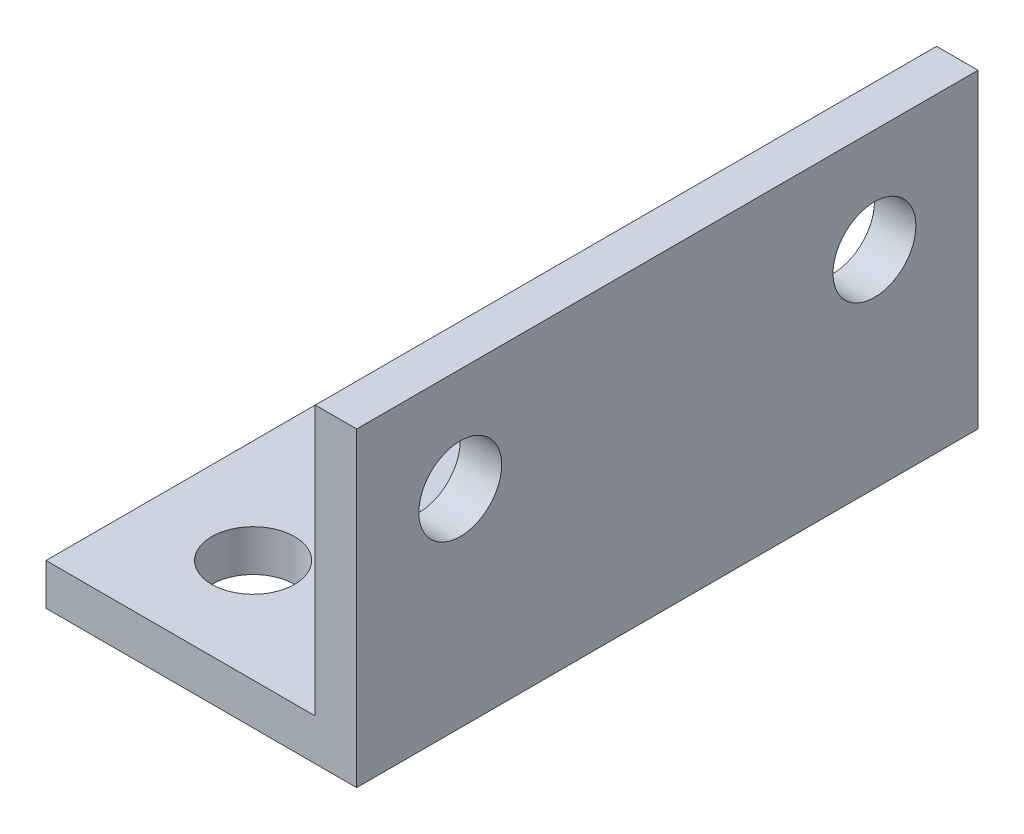
ISO-10303-21;
HEADER;
FILE_DESCRIPTION(('STEP AP214'),'2;1');
FILE_NAME('part.step','',(''),(''),'','','');
FILE_SCHEMA(('AUTOMOTIVE_DESIGN { 1 0 10303 214 1 1 1 1 }'));
ENDSEC;
DATA;
#1=APPLICATION_CONTEXT('core data for automotive mechanical design processes');
#2=APPLICATION_PROTOCOL_DEFINITION('international standard','automotive_design',2000,#1);
#3=PRODUCT_CONTEXT('',#1,'mechanical');
#4=PRODUCT('Part','Part','',(#3));
#5=PRODUCT_RELATED_PRODUCT_CATEGORY('part','',(#4));
#6=PRODUCT_DEFINITION_FORMATION('','',#4);
#7=PRODUCT_DEFINITION_CONTEXT('part definition',#1,'design');
#8=PRODUCT_DEFINITION('design','',#6,#7);
#9=PRODUCT_DEFINITION_SHAPE('','',#8);
#10=(LENGTH_UNIT() NAMED_UNIT(*) SI_UNIT(.MILLI.,.METRE.));
#11=(NAMED_UNIT(*) PLANE_ANGLE_UNIT() SI_UNIT($,.RADIAN.));
#12=(NAMED_UNIT(*) SI_UNIT($,.STERADIAN.) SOLID_ANGLE_UNIT());
#13=UNCERTAINTY_MEASURE_WITH_UNIT(LENGTH_MEASURE(1.E-05),#10,'distance_accuracy_value','');
#14=(GEOMETRIC_REPRESENTATION_CONTEXT(3) GLOBAL_UNCERTAINTY_ASSIGNED_CONTEXT((#13)) GLOBAL_UNIT_ASSIGNED_CONTEXT((#10,
#11,#12)) REPRESENTATION_CONTEXT('',''));
#15=CARTESIAN_POINT('',(0.,0.,0.));
#16=DIRECTION('',(0.,0.,1.));
#17=DIRECTION('',(1.,0.,0.));
#18=AXIS2_PLACEMENT_3D('',#15,#16,#17);
#19=CARTESIAN_POINT('',(-2.,15.,30.));
#20=DIRECTION('',(0.,-1.,0.));
#21=DIRECTION('',(0.,0.,-1.));
#22=AXIS2_PLACEMENT_3D('',#19,#20,#21);
#23=PLANE('',#22);
#24=DIRECTION('',(-1.,0.,0.));
#25=VECTOR('',#24,1.);
#26=CARTESIAN_POINT('',(-2.,15.,0.));
#27=LINE('',#26,#25);
#28=CARTESIAN_POINT('',(0.,15.,0.));
#29=VERTEX_POINT('',#28);
#30=CARTESIAN_POINT('',(-2.,15.,0.));
#31=VERTEX_POINT('',#30);
#32=EDGE_CURVE('E118',#29,#31,#27,.T.);
#33=ORIENTED_EDGE('',*,*,#32,.T.);
#34=DIRECTION('',(0.,0.,-1.));
#35=VECTOR('',#34,1.);
#36=CARTESIAN_POINT('',(-2.,15.,30.));
#37=LINE('',#36,#35);
#38=CARTESIAN_POINT('',(-2.,15.,30.));
#39=VERTEX_POINT('',#38);
#40=EDGE_CURVE('E11',#39,#31,#37,.T.);
#41=ORIENTED_EDGE('',*,*,#40,.F.);
#42=DIRECTION('',(-1.,0.,0.));
#43=VECTOR('',#42,1.);
#44=CARTESIAN_POINT('',(-2.,15.,30.));
#45=LINE('',#44,#43);
#46=CARTESIAN_POINT('',(0.,15.,30.));
#47=VERTEX_POINT('',#46);
#48=EDGE_CURVE('E129',#47,#39,#45,.T.);
#49=ORIENTED_EDGE('',*,*,#48,.F.);
#50=DIRECTION('',(0.,0.,-1.));
#51=VECTOR('',#50,1.);
#52=CARTESIAN_POINT('',(0.,15.,30.));
#53=LINE('',#52,#51);
#54=EDGE_CURVE('E114',#47,#29,#53,.T.);
#55=ORIENTED_EDGE('',*,*,#54,.T.);
#56=EDGE_LOOP('',(#33,#41,#49,#55));
#57=FACE_BOUND('',#56,.T.);
#58=ADVANCED_FACE('F34',(#57),#23,.F.);
#59=CARTESIAN_POINT('',(-2.,15.,30.));
#60=DIRECTION('',(1.,0.,0.));
#61=DIRECTION('',(0.,0.,-1.));
#62=AXIS2_PLACEMENT_3D('',#59,#60,#61);
#63=PLANE('',#62);
#64=CARTESIAN_POINT('',(-2.,10.,25.));
#65=DIRECTION('',(1.,0.,0.));
#66=DIRECTION('',(0.,0.,-1.));
#67=AXIS2_PLACEMENT_3D('',#64,#65,#66);
#68=CIRCLE('',#67,2.);
#69=CARTESIAN_POINT('',(-2.,10.,23.));
#70=VERTEX_POINT('',#69);
#71=EDGE_CURVE('E122',#70,#70,#68,.F.);
#72=ORIENTED_EDGE('',*,*,#71,.F.);
#73=EDGE_LOOP('',(#72));
#74=FACE_BOUND('',#73,.T.);
#75=CARTESIAN_POINT('',(-2.,10.,5.));
#76=DIRECTION('',(1.,0.,0.));
#77=DIRECTION('',(0.,0.,-1.));
#78=AXIS2_PLACEMENT_3D('',#75,#76,#77);
#79=CIRCLE('',#78,2.);
#80=CARTESIAN_POINT('',(-2.,10.,3.));
#81=VERTEX_POINT('',#80);
#82=EDGE_CURVE('E262',#81,#81,#79,.F.);
#83=ORIENTED_EDGE('',*,*,#82,.F.);
#84=EDGE_LOOP('',(#83));
#85=FACE_BOUND('',#84,.T.);
#86=DIRECTION('',(0.,-1.,0.));
#87=VECTOR('',#86,1.);
#88=CARTESIAN_POINT('',(-2.,15.,0.));
#89=LINE('',#88,#87);
#90=CARTESIAN_POINT('',(-2.,2.,0.));
#91=VERTEX_POINT('',#90);
#92=EDGE_CURVE('E121',#31,#91,#89,.T.);
#93=ORIENTED_EDGE('',*,*,#92,.T.);
#94=DIRECTION('',(0.,0.,-1.));
#95=VECTOR('',#94,1.);
#96=CARTESIAN_POINT('',(-2.,2.,30.));
#97=LINE('',#96,#95);
#98=CARTESIAN_POINT('',(-2.,2.,30.));
#99=VERTEX_POINT('',#98);
#100=EDGE_CURVE('E42',#99,#91,#97,.T.);
#101=ORIENTED_EDGE('',*,*,#100,.F.);
#102=DIRECTION('',(0.,-1.,0.));
#103=VECTOR('',#102,1.);
#104=CARTESIAN_POINT('',(-2.,15.,30.));
#105=LINE('',#104,#103);
#106=EDGE_CURVE('E87',#39,#99,#105,.T.);
#107=ORIENTED_EDGE('',*,*,#106,.F.);
#108=ORIENTED_EDGE('',*,*,#40,.T.);
#109=EDGE_LOOP('',(#93,#101,#107,#108));
#110=FACE_BOUND('',#109,.T.);
#111=ADVANCED_FACE('F157',(#74,#85,#110),#63,.F.);
#112=CARTESIAN_POINT('',(-2.,2.,30.));
#113=DIRECTION('',(0.,-1.,0.));
#114=DIRECTION('',(0.,0.,-1.));
#115=AXIS2_PLACEMENT_3D('',#112,#113,#114);
#116=PLANE('',#115);
#117=CARTESIAN_POINT('',(-10.,2.,5.));
#118=DIRECTION('',(0.,1.,0.));
#119=DIRECTION('',(0.,0.,1.));
#120=AXIS2_PLACEMENT_3D('',#117,#118,#119);
#121=CIRCLE('',#120,2.);
#122=CARTESIAN_POINT('',(-10.,2.,7.));
#123=VERTEX_POINT('',#122);
#124=EDGE_CURVE('E277',#123,#123,#121,.T.);
#125=ORIENTED_EDGE('',*,*,#124,.F.);
#126=EDGE_LOOP('',(#125));
#127=FACE_BOUND('',#126,.T.);
#128=CARTESIAN_POINT('',(-10.,2.,25.));
#129=DIRECTION('',(0.,1.,0.));
#130=DIRECTION('',(0.,0.,1.));
#131=AXIS2_PLACEMENT_3D('',#128,#129,#130);
#132=CIRCLE('',#131,2.);
#133=CARTESIAN_POINT('',(-10.,2.,27.));
#134=VERTEX_POINT('',#133);
#135=EDGE_CURVE('E278',#134,#134,#132,.T.);
#136=ORIENTED_EDGE('',*,*,#135,.F.);
#137=EDGE_LOOP('',(#136));
#138=FACE_BOUND('',#137,.T.);
#139=DIRECTION('',(-1.,0.,0.));
#140=VECTOR('',#139,1.);
#141=CARTESIAN_POINT('',(-2.,2.,0.));
#142=LINE('',#141,#140);
#143=CARTESIAN_POINT('',(-15.,2.,0.));
#144=VERTEX_POINT('',#143);
#145=EDGE_CURVE('E124',#91,#144,#142,.T.);
#146=ORIENTED_EDGE('',*,*,#145,.T.);
#147=DIRECTION('',(0.,0.,-1.));
#148=VECTOR('',#147,1.);
#149=CARTESIAN_POINT('',(-15.,2.,30.));
#150=LINE('',#149,#148);
#151=CARTESIAN_POINT('',(-15.,2.,30.));
#152=VERTEX_POINT('',#151);
#153=EDGE_CURVE('E109',#152,#144,#150,.T.);
#154=ORIENTED_EDGE('',*,*,#153,.F.);
#155=DIRECTION('',(-1.,0.,0.));
#156=VECTOR('',#155,1.);
#157=CARTESIAN_POINT('',(-2.,2.,30.));
#158=LINE('',#157,#156);
#159=EDGE_CURVE('E100',#99,#152,#158,.T.);
#160=ORIENTED_EDGE('',*,*,#159,.F.);
#161=ORIENTED_EDGE('',*,*,#100,.T.);
#162=EDGE_LOOP('',(#146,#154,#160,#161));
#163=FACE_BOUND('',#162,.T.);
#164=ADVANCED_FACE('F135',(#127,#138,#163),#116,.F.);
#165=CARTESIAN_POINT('',(-15.,2.,30.));
#166=DIRECTION('',(1.,0.,0.));
#167=DIRECTION('',(0.,0.,-1.));
#168=AXIS2_PLACEMENT_3D('',#165,#166,#167);
#169=PLANE('',#168);
#170=DIRECTION('',(0.,-1.,0.));
#171=VECTOR('',#170,1.);
#172=CARTESIAN_POINT('',(-15.,2.,0.));
#173=LINE('',#172,#171);
#174=CARTESIAN_POINT('',(-15.,0.,0.));
#175=VERTEX_POINT('',#174);
#176=EDGE_CURVE('E108',#144,#175,#173,.T.);
#177=ORIENTED_EDGE('',*,*,#176,.T.);
#178=DIRECTION('',(0.,0.,-1.));
#179=VECTOR('',#178,1.);
#180=CARTESIAN_POINT('',(-15.,0.,30.));
#181=LINE('',#180,#179);
#182=CARTESIAN_POINT('',(-15.,0.,30.));
#183=VERTEX_POINT('',#182);
#184=EDGE_CURVE('E105',#183,#175,#181,.T.);
#185=ORIENTED_EDGE('',*,*,#184,.F.);
#186=DIRECTION('',(0.,-1.,0.));
#187=VECTOR('',#186,1.);
#188=CARTESIAN_POINT('',(-15.,2.,30.));
#189=LINE('',#188,#187);
#190=EDGE_CURVE('E94',#152,#183,#189,.T.);
#191=ORIENTED_EDGE('',*,*,#190,.F.);
#192=ORIENTED_EDGE('',*,*,#153,.T.);
#193=EDGE_LOOP('',(#177,#185,#191,#192));
#194=FACE_BOUND('',#193,.T.);
#195=ADVANCED_FACE('F106',(#194),#169,.F.);
#196=CARTESIAN_POINT('',(0.,0.,30.));
#197=DIRECTION('',(0.,1.,0.));
#198=DIRECTION('',(-1.,0.,0.));
#199=AXIS2_PLACEMENT_3D('',#196,#197,#198);
#200=PLANE('',#199);
#201=CARTESIAN_POINT('',(-10.,0.,5.));
#202=DIRECTION('',(0.,1.,0.));
#203=DIRECTION('',(-1.,0.,0.));
#204=AXIS2_PLACEMENT_3D('',#201,#202,#203);
#205=CIRCLE('',#204,2.);
#206=CARTESIAN_POINT('',(-12.,0.,5.));
#207=VERTEX_POINT('',#206);
#208=EDGE_CURVE('E267',#207,#207,#205,.F.);
#209=ORIENTED_EDGE('',*,*,#208,.F.);
#210=EDGE_LOOP('',(#209));
#211=FACE_BOUND('',#210,.T.);
#212=CARTESIAN_POINT('',(-10.,0.,25.));
#213=DIRECTION('',(0.,1.,0.));
#214=DIRECTION('',(-1.,0.,0.));
#215=AXIS2_PLACEMENT_3D('',#212,#213,#214);
#216=CIRCLE('',#215,2.);
#217=CARTESIAN_POINT('',(-12.,0.,25.));
#218=VERTEX_POINT('',#217);
#219=EDGE_CURVE('E274',#218,#218,#216,.F.);
#220=ORIENTED_EDGE('',*,*,#219,.F.);
#221=EDGE_LOOP('',(#220));
#222=FACE_BOUND('',#221,.T.);
#223=DIRECTION('',(1.,0.,0.));
#224=VECTOR('',#223,1.);
#225=CARTESIAN_POINT('',(0.,0.,0.));
#226=LINE('',#225,#224);
#227=CARTESIAN_POINT('',(0.,0.,0.));
#228=VERTEX_POINT('',#227);
#229=EDGE_CURVE('E73',#175,#228,#226,.T.);
#230=ORIENTED_EDGE('',*,*,#229,.T.);
#231=DIRECTION('',(0.,0.,-1.));
#232=VECTOR('',#231,1.);
#233=CARTESIAN_POINT('',(0.,0.,30.));
#234=LINE('',#233,#232);
#235=CARTESIAN_POINT('',(0.,0.,30.));
#236=VERTEX_POINT('',#235);
#237=EDGE_CURVE('E110',#236,#228,#234,.T.);
#238=ORIENTED_EDGE('',*,*,#237,.F.);
#239=DIRECTION('',(1.,0.,0.));
#240=VECTOR('',#239,1.);
#241=CARTESIAN_POINT('',(0.,0.,30.));
#242=LINE('',#241,#240);
#243=EDGE_CURVE('E98',#183,#236,#242,.T.);
#244=ORIENTED_EDGE('',*,*,#243,.F.);
#245=ORIENTED_EDGE('',*,*,#184,.T.);
#246=EDGE_LOOP('',(#230,#238,#244,#245));
#247=FACE_BOUND('',#246,.T.);
#248=ADVANCED_FACE('F112',(#211,#222,#247),#200,.F.);
#249=CARTESIAN_POINT('',(0.,15.,30.));
#250=DIRECTION('',(-1.,0.,0.));
#251=DIRECTION('',(0.,0.,1.));
#252=AXIS2_PLACEMENT_3D('',#249,#250,#251);
#253=PLANE('',#252);
#254=CARTESIAN_POINT('',(0.,10.,25.));
#255=DIRECTION('',(1.,0.,0.));
#256=DIRECTION('',(0.,0.,-1.));
#257=AXIS2_PLACEMENT_3D('',#254,#255,#256);
#258=CIRCLE('',#257,2.);
#259=CARTESIAN_POINT('',(0.,10.,23.));
#260=VERTEX_POINT('',#259);
#261=EDGE_CURVE('E263',#260,#260,#258,.T.);
#262=ORIENTED_EDGE('',*,*,#261,.F.);
#263=EDGE_LOOP('',(#262));
#264=FACE_BOUND('',#263,.T.);
#265=CARTESIAN_POINT('',(0.,10.,5.));
#266=DIRECTION('',(1.,0.,0.));
#267=DIRECTION('',(0.,0.,-1.));
#268=AXIS2_PLACEMENT_3D('',#265,#266,#267);
#269=CIRCLE('',#268,2.);
#270=CARTESIAN_POINT('',(0.,10.,3.));
#271=VERTEX_POINT('',#270);
#272=EDGE_CURVE('E259',#271,#271,#269,.T.);
#273=ORIENTED_EDGE('',*,*,#272,.F.);
#274=EDGE_LOOP('',(#273));
#275=FACE_BOUND('',#274,.T.);
#276=DIRECTION('',(0.,1.,0.));
#277=VECTOR('',#276,1.);
#278=CARTESIAN_POINT('',(0.,15.,0.));
#279=LINE('',#278,#277);
#280=EDGE_CURVE('E79',#228,#29,#279,.T.);
#281=ORIENTED_EDGE('',*,*,#280,.T.);
#282=ORIENTED_EDGE('',*,*,#54,.F.);
#283=DIRECTION('',(0.,1.,0.));
#284=VECTOR('',#283,1.);
#285=CARTESIAN_POINT('',(0.,15.,30.));
#286=LINE('',#285,#284);
#287=EDGE_CURVE('E50',#236,#47,#286,.T.);
#288=ORIENTED_EDGE('',*,*,#287,.F.);
#289=ORIENTED_EDGE('',*,*,#237,.T.);
#290=EDGE_LOOP('',(#281,#282,#288,#289));
#291=FACE_BOUND('',#290,.T.);
#292=ADVANCED_FACE('F142',(#264,#275,#291),#253,.F.);
#293=CARTESIAN_POINT('',(0.,0.,30.));
#294=DIRECTION('',(0.,0.,-1.));
#295=DIRECTION('',(-1.,0.,0.));
#296=AXIS2_PLACEMENT_3D('',#293,#294,#295);
#297=PLANE('',#296);
#298=ORIENTED_EDGE('',*,*,#48,.T.);
#299=ORIENTED_EDGE('',*,*,#106,.T.);
#300=ORIENTED_EDGE('',*,*,#159,.T.);
#301=ORIENTED_EDGE('',*,*,#190,.T.);
#302=ORIENTED_EDGE('',*,*,#243,.T.);
#303=ORIENTED_EDGE('',*,*,#287,.T.);
#304=EDGE_LOOP('',(#298,#299,#300,#301,#302,#303));
#305=FACE_BOUND('',#304,.T.);
#306=ADVANCED_FACE('F96',(#305),#297,.F.);
#307=CARTESIAN_POINT('',(0.,0.,0.));
#308=DIRECTION('',(0.,0.,-1.));
#309=DIRECTION('',(-1.,0.,0.));
#310=AXIS2_PLACEMENT_3D('',#307,#308,#309);
#311=PLANE('',#310);
#312=ORIENTED_EDGE('',*,*,#32,.F.);
#313=ORIENTED_EDGE('',*,*,#280,.F.);
#314=ORIENTED_EDGE('',*,*,#229,.F.);
#315=ORIENTED_EDGE('',*,*,#176,.F.);
#316=ORIENTED_EDGE('',*,*,#145,.F.);
#317=ORIENTED_EDGE('',*,*,#92,.F.);
#318=EDGE_LOOP('',(#312,#313,#314,#315,#316,#317));
#319=FACE_BOUND('',#318,.T.);
#320=ADVANCED_FACE('F138',(#319),#311,.T.);
#321=CARTESIAN_POINT('',(-15.001,10.,5.));
#322=DIRECTION('',(1.,0.,0.));
#323=DIRECTION('',(0.,0.,-1.));
#324=AXIS2_PLACEMENT_3D('',#321,#322,#323);
#325=CYLINDRICAL_SURFACE('',#324,2.);
#326=ORIENTED_EDGE('',*,*,#272,.T.);
#327=EDGE_LOOP('',(#326));
#328=FACE_BOUND('',#327,.T.);
#329=ORIENTED_EDGE('',*,*,#82,.T.);
#330=EDGE_LOOP('',(#329));
#331=FACE_BOUND('',#330,.T.);
#332=ADVANCED_FACE('F215',(#328,#331),#325,.F.);
#333=CARTESIAN_POINT('',(-15.001,10.,25.));
#334=DIRECTION('',(1.,0.,0.));
#335=DIRECTION('',(0.,0.,-1.));
#336=AXIS2_PLACEMENT_3D('',#333,#334,#335);
#337=CYLINDRICAL_SURFACE('',#336,2.);
#338=ORIENTED_EDGE('',*,*,#261,.T.);
#339=EDGE_LOOP('',(#338));
#340=FACE_BOUND('',#339,.T.);
#341=ORIENTED_EDGE('',*,*,#71,.T.);
#342=EDGE_LOOP('',(#341));
#343=FACE_BOUND('',#342,.T.);
#344=ADVANCED_FACE('F195',(#340,#343),#337,.F.);
#345=CARTESIAN_POINT('',(-10.,-0.00100000000000187,25.));
#346=DIRECTION('',(0.,1.,0.));
#347=DIRECTION('',(0.,0.,1.));
#348=AXIS2_PLACEMENT_3D('',#345,#346,#347);
#349=CYLINDRICAL_SURFACE('',#348,2.);
#350=ORIENTED_EDGE('',*,*,#135,.T.);
#351=EDGE_LOOP('',(#350));
#352=FACE_BOUND('',#351,.T.);
#353=ORIENTED_EDGE('',*,*,#219,.T.);
#354=EDGE_LOOP('',(#353));
#355=FACE_BOUND('',#354,.T.);
#356=ADVANCED_FACE('F189',(#352,#355),#349,.F.);
#357=CARTESIAN_POINT('',(-10.,-0.00100000000000187,5.));
#358=DIRECTION('',(0.,1.,0.));
#359=DIRECTION('',(0.,0.,1.));
#360=AXIS2_PLACEMENT_3D('',#357,#358,#359);
#361=CYLINDRICAL_SURFACE('',#360,2.);
#362=ORIENTED_EDGE('',*,*,#124,.T.);
#363=EDGE_LOOP('',(#362));
#364=FACE_BOUND('',#363,.T.);
#365=ORIENTED_EDGE('',*,*,#208,.T.);
#366=EDGE_LOOP('',(#365));
#367=FACE_BOUND('',#366,.T.);
#368=ADVANCED_FACE('F194',(#364,#367),#361,.F.);
#369=CLOSED_SHELL('',(#58,#111,#164,#195,#248,#292,#306,#320,#332,#344,#356,#368));
#370=MANIFOLD_SOLID_BREP('B2',#369);
#371=ADVANCED_BREP_SHAPE_REPRESENTATION('',(#18,#370),#14);
#372=SHAPE_DEFINITION_REPRESENTATION(#9,#371);
ENDSEC;
END-ISO-10303-21;
